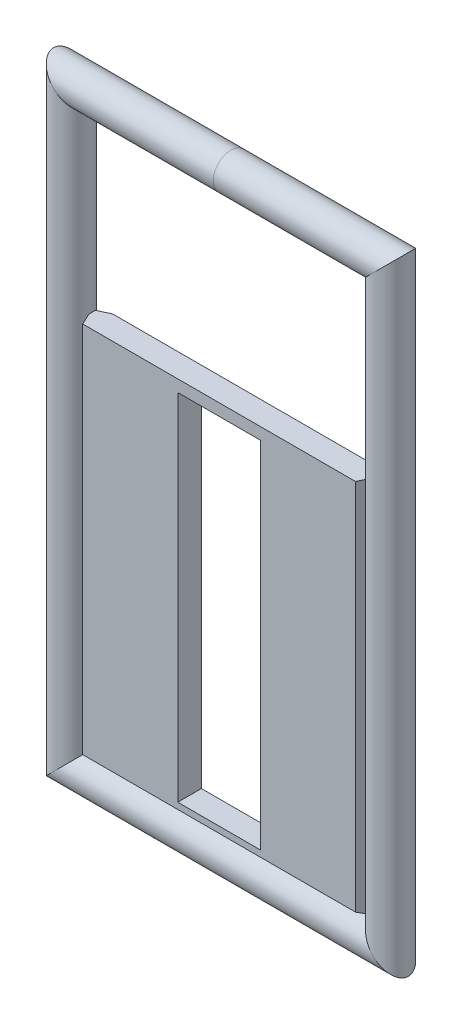
ISO-10303-21;
HEADER;
FILE_DESCRIPTION(('STEP AP214'),'2;1');
FILE_NAME('part.step','',(''),(''),'','','');
FILE_SCHEMA(('AUTOMOTIVE_DESIGN { 1 0 10303 214 1 1 1 1 }'));
ENDSEC;
DATA;
#1=APPLICATION_CONTEXT('core data for automotive mechanical design processes');
#2=APPLICATION_PROTOCOL_DEFINITION('international standard','automotive_design',2000,#1);
#3=PRODUCT_CONTEXT('',#1,'mechanical');
#4=PRODUCT('Part','Part','',(#3));
#5=PRODUCT_RELATED_PRODUCT_CATEGORY('part','',(#4));
#6=PRODUCT_DEFINITION_FORMATION('','',#4);
#7=PRODUCT_DEFINITION_CONTEXT('part definition',#1,'design');
#8=PRODUCT_DEFINITION('design','',#6,#7);
#9=PRODUCT_DEFINITION_SHAPE('','',#8);
#10=(LENGTH_UNIT() NAMED_UNIT(*) SI_UNIT(.MILLI.,.METRE.));
#11=(NAMED_UNIT(*) PLANE_ANGLE_UNIT() SI_UNIT($,.RADIAN.));
#12=(NAMED_UNIT(*) SI_UNIT($,.STERADIAN.) SOLID_ANGLE_UNIT());
#13=UNCERTAINTY_MEASURE_WITH_UNIT(LENGTH_MEASURE(1.E-05),#10,'distance_accuracy_value','');
#14=(GEOMETRIC_REPRESENTATION_CONTEXT(3) GLOBAL_UNCERTAINTY_ASSIGNED_CONTEXT((#13)) GLOBAL_UNIT_ASSIGNED_CONTEXT((#10,
#11,#12)) REPRESENTATION_CONTEXT('',''));
#15=CARTESIAN_POINT('',(0.,0.,0.));
#16=DIRECTION('',(0.,0.,1.));
#17=DIRECTION('',(1.,0.,0.));
#18=AXIS2_PLACEMENT_3D('',#15,#16,#17);
#19=CARTESIAN_POINT('',(6.,-24.25,-0.5));
#20=DIRECTION('',(1.,0.,0.));
#21=DIRECTION('',(0.,0.,-1.));
#22=AXIS2_PLACEMENT_3D('',#19,#20,#21);
#23=PLANE('',#22);
#24=DIRECTION('',(0.,0.,1.));
#25=VECTOR('',#24,1.);
#26=CARTESIAN_POINT('',(6.,-24.25,-0.5));
#27=LINE('',#26,#25);
#28=CARTESIAN_POINT('',(6.,-24.25,-0.266846170922501));
#29=VERTEX_POINT('',#28);
#30=CARTESIAN_POINT('',(6.,-24.25,0.));
#31=VERTEX_POINT('',#30);
#32=EDGE_CURVE('E202',#29,#31,#27,.T.);
#33=ORIENTED_EDGE('',*,*,#32,.F.);
#34=DIRECTION('',(0.,1.,0.));
#35=VECTOR('',#34,1.);
#36=CARTESIAN_POINT('',(6.,-8.25,-0.266846170922501));
#37=LINE('',#36,#35);
#38=CARTESIAN_POINT('',(6.,-8.25,-0.266846170922501));
#39=VERTEX_POINT('',#38);
#40=EDGE_CURVE('E240',#29,#39,#37,.T.);
#41=ORIENTED_EDGE('',*,*,#40,.T.);
#42=DIRECTION('',(0.,0.,1.));
#43=VECTOR('',#42,1.);
#44=CARTESIAN_POINT('',(6.,-8.25,-0.5));
#45=LINE('',#44,#43);
#46=CARTESIAN_POINT('',(6.,-8.25,0.));
#47=VERTEX_POINT('',#46);
#48=EDGE_CURVE('E201',#39,#47,#45,.T.);
#49=ORIENTED_EDGE('',*,*,#48,.T.);
#50=DIRECTION('',(0.,-1.,0.));
#51=VECTOR('',#50,1.);
#52=CARTESIAN_POINT('',(6.,-24.25,0.));
#53=LINE('',#52,#51);
#54=EDGE_CURVE('E238',#47,#31,#53,.T.);
#55=ORIENTED_EDGE('',*,*,#54,.T.);
#56=EDGE_LOOP('',(#33,#41,#49,#55));
#57=FACE_BOUND('',#56,.T.);
#58=ADVANCED_FACE('F60',(#57),#23,.T.);
#59=CARTESIAN_POINT('',(6.,-24.25,-0.5));
#60=DIRECTION('',(0.,-1.,0.));
#61=DIRECTION('',(0.,0.,-1.));
#62=AXIS2_PLACEMENT_3D('',#59,#60,#61);
#63=PLANE('',#62);
#64=DIRECTION('',(0.,0.,1.));
#65=VECTOR('',#64,1.);
#66=CARTESIAN_POINT('',(-6.,-24.25,-0.5));
#67=LINE('',#66,#65);
#68=CARTESIAN_POINT('',(-6.,-24.25,-0.266846170922501));
#69=VERTEX_POINT('',#68);
#70=CARTESIAN_POINT('',(-6.,-24.25,0.));
#71=VERTEX_POINT('',#70);
#72=EDGE_CURVE('E206',#69,#71,#67,.T.);
#73=ORIENTED_EDGE('',*,*,#72,.F.);
#74=DIRECTION('',(1.,0.,0.));
#75=VECTOR('',#74,1.);
#76=CARTESIAN_POINT('',(6.,-24.25,-0.266846170922501));
#77=LINE('',#76,#75);
#78=EDGE_CURVE('E236',#69,#29,#77,.T.);
#79=ORIENTED_EDGE('',*,*,#78,.T.);
#80=ORIENTED_EDGE('',*,*,#32,.T.);
#81=DIRECTION('',(-1.,0.,0.));
#82=VECTOR('',#81,1.);
#83=CARTESIAN_POINT('',(6.,-24.25,0.));
#84=LINE('',#83,#82);
#85=EDGE_CURVE('E234',#31,#71,#84,.T.);
#86=ORIENTED_EDGE('',*,*,#85,.T.);
#87=EDGE_LOOP('',(#73,#79,#80,#86));
#88=FACE_BOUND('',#87,.T.);
#89=ADVANCED_FACE('F275',(#88),#63,.T.);
#90=CARTESIAN_POINT('',(-6.,-24.25,-0.5));
#91=DIRECTION('',(-1.,0.,0.));
#92=DIRECTION('',(0.,-1.,0.));
#93=AXIS2_PLACEMENT_3D('',#90,#91,#92);
#94=PLANE('',#93);
#95=DIRECTION('',(0.,0.,1.));
#96=VECTOR('',#95,1.);
#97=CARTESIAN_POINT('',(-6.,-8.25,-0.5));
#98=LINE('',#97,#96);
#99=CARTESIAN_POINT('',(-6.,-8.25,-0.266846170922501));
#100=VERTEX_POINT('',#99);
#101=CARTESIAN_POINT('',(-6.,-8.25,0.));
#102=VERTEX_POINT('',#101);
#103=EDGE_CURVE('E209',#100,#102,#98,.T.);
#104=ORIENTED_EDGE('',*,*,#103,.F.);
#105=DIRECTION('',(0.,-1.,0.));
#106=VECTOR('',#105,1.);
#107=CARTESIAN_POINT('',(-6.,-24.25,-0.266846170922501));
#108=LINE('',#107,#106);
#109=EDGE_CURVE('E215',#100,#69,#108,.T.);
#110=ORIENTED_EDGE('',*,*,#109,.T.);
#111=ORIENTED_EDGE('',*,*,#72,.T.);
#112=DIRECTION('',(0.,1.,0.));
#113=VECTOR('',#112,1.);
#114=CARTESIAN_POINT('',(-6.,-24.25,0.));
#115=LINE('',#114,#113);
#116=EDGE_CURVE('E205',#71,#102,#115,.T.);
#117=ORIENTED_EDGE('',*,*,#116,.T.);
#118=EDGE_LOOP('',(#104,#110,#111,#117));
#119=FACE_BOUND('',#118,.T.);
#120=ADVANCED_FACE('F261',(#119),#94,.T.);
#121=CARTESIAN_POINT('',(6.,-8.25,-0.5));
#122=DIRECTION('',(0.,1.,0.));
#123=DIRECTION('',(0.,0.,1.));
#124=AXIS2_PLACEMENT_3D('',#121,#122,#123);
#125=PLANE('',#124);
#126=DIRECTION('',(-1.,0.,0.));
#127=VECTOR('',#126,1.);
#128=CARTESIAN_POINT('',(6.,-8.25,-0.5));
#129=LINE('',#128,#127);
#130=CARTESIAN_POINT('',(5.5,-8.25,-0.5));
#131=VERTEX_POINT('',#130);
#132=CARTESIAN_POINT('',(-5.49999999999999,-8.25,-0.5));
#133=VERTEX_POINT('',#132);
#134=EDGE_CURVE('E195',#131,#133,#129,.T.);
#135=ORIENTED_EDGE('',*,*,#134,.T.);
#136=DIRECTION('',(-0.906307787036651,0.,0.422618261740697));
#137=VECTOR('',#136,1.);
#138=CARTESIAN_POINT('',(3.94602875569763,-8.25,-4.9047555479341));
#139=LINE('',#138,#137);
#140=EDGE_CURVE('E232',#133,#100,#139,.T.);
#141=ORIENTED_EDGE('',*,*,#140,.T.);
#142=ORIENTED_EDGE('',*,*,#103,.T.);
#143=DIRECTION('',(-0.422618261740696,0.,-0.906307787036652));
#144=VECTOR('',#143,1.);
#145=CARTESIAN_POINT('',(-4.04823676889901,-8.25,4.1855697562922));
#146=LINE('',#145,#144);
#147=CARTESIAN_POINT('',(-5.7668461709225,-8.25,0.5));
#148=VERTEX_POINT('',#147);
#149=EDGE_CURVE('E226',#102,#148,#146,.F.);
#150=ORIENTED_EDGE('',*,*,#149,.T.);
#151=DIRECTION('',(-1.,0.,0.));
#152=VECTOR('',#151,1.);
#153=CARTESIAN_POINT('',(6.,-8.25,0.5));
#154=LINE('',#153,#152);
#155=CARTESIAN_POINT('',(5.7668461709225,-8.25,0.5));
#156=VERTEX_POINT('',#155);
#157=EDGE_CURVE('E184',#156,#148,#154,.T.);
#158=ORIENTED_EDGE('',*,*,#157,.F.);
#159=DIRECTION('',(-0.422618261740697,0.,0.906307787036651));
#160=VECTOR('',#159,1.);
#161=CARTESIAN_POINT('',(6.19151111077974,-8.25,-0.410696902421637));
#162=LINE('',#161,#160);
#163=EDGE_CURVE('E228',#156,#47,#162,.F.);
#164=ORIENTED_EDGE('',*,*,#163,.T.);
#165=ORIENTED_EDGE('',*,*,#48,.F.);
#166=DIRECTION('',(-0.906307787036651,0.,-0.422618261740697));
#167=VECTOR('',#166,1.);
#168=CARTESIAN_POINT('',(5.91069690242163,-8.25,-0.308488889220255));
#169=LINE('',#168,#167);
#170=EDGE_CURVE('E230',#39,#131,#169,.T.);
#171=ORIENTED_EDGE('',*,*,#170,.T.);
#172=EDGE_LOOP('',(#135,#141,#142,#150,#158,#164,#165,#171));
#173=FACE_BOUND('',#172,.T.);
#174=ADVANCED_FACE('F265',(#173),#125,.T.);
#175=CARTESIAN_POINT('',(0.,0.,-0.5));
#176=DIRECTION('',(0.,0.,1.));
#177=DIRECTION('',(1.,0.,0.));
#178=AXIS2_PLACEMENT_3D('',#175,#176,#177);
#179=PLANE('',#178);
#180=DIRECTION('',(-1.,0.,0.));
#181=VECTOR('',#180,1.);
#182=CARTESIAN_POINT('',(-6.,-23.75,-0.5));
#183=LINE('',#182,#181);
#184=CARTESIAN_POINT('',(-1.75,-23.75,-0.5));
#185=VERTEX_POINT('',#184);
#186=CARTESIAN_POINT('',(-5.49999999999999,-23.75,-0.5));
#187=VERTEX_POINT('',#186);
#188=EDGE_CURVE('E222',#185,#187,#183,.T.);
#189=ORIENTED_EDGE('',*,*,#188,.T.);
#190=DIRECTION('',(0.,1.,0.));
#191=VECTOR('',#190,1.);
#192=CARTESIAN_POINT('',(-5.49999999999999,-8.25,-0.5));
#193=LINE('',#192,#191);
#194=EDGE_CURVE('E224',#187,#133,#193,.T.);
#195=ORIENTED_EDGE('',*,*,#194,.T.);
#196=ORIENTED_EDGE('',*,*,#134,.F.);
#197=DIRECTION('',(0.,-1.,0.));
#198=VECTOR('',#197,1.);
#199=CARTESIAN_POINT('',(5.5,-24.25,-0.5));
#200=LINE('',#199,#198);
#201=CARTESIAN_POINT('',(5.5,-23.75,-0.5));
#202=VERTEX_POINT('',#201);
#203=EDGE_CURVE('E218',#131,#202,#200,.T.);
#204=ORIENTED_EDGE('',*,*,#203,.T.);
#205=DIRECTION('',(-1.,0.,0.));
#206=VECTOR('',#205,1.);
#207=CARTESIAN_POINT('',(-6.,-23.75,-0.5));
#208=LINE('',#207,#206);
#209=CARTESIAN_POINT('',(1.75,-23.75,-0.5));
#210=VERTEX_POINT('',#209);
#211=EDGE_CURVE('E220',#202,#210,#208,.T.);
#212=ORIENTED_EDGE('',*,*,#211,.T.);
#213=DIRECTION('',(0.,1.,0.));
#214=VECTOR('',#213,1.);
#215=CARTESIAN_POINT('',(1.75,-8.75,-0.5));
#216=LINE('',#215,#214);
#217=CARTESIAN_POINT('',(1.75,-8.75,-0.5));
#218=VERTEX_POINT('',#217);
#219=EDGE_CURVE('E186',#210,#218,#216,.T.);
#220=ORIENTED_EDGE('',*,*,#219,.T.);
#221=DIRECTION('',(-1.,0.,0.));
#222=VECTOR('',#221,1.);
#223=CARTESIAN_POINT('',(-1.75,-8.75,-0.5));
#224=LINE('',#223,#222);
#225=CARTESIAN_POINT('',(-1.75,-8.75,-0.5));
#226=VERTEX_POINT('',#225);
#227=EDGE_CURVE('E159',#218,#226,#224,.T.);
#228=ORIENTED_EDGE('',*,*,#227,.T.);
#229=DIRECTION('',(0.,-1.,0.));
#230=VECTOR('',#229,1.);
#231=CARTESIAN_POINT('',(-1.75,-8.75,-0.5));
#232=LINE('',#231,#230);
#233=EDGE_CURVE('E189',#226,#185,#232,.T.);
#234=ORIENTED_EDGE('',*,*,#233,.T.);
#235=EDGE_LOOP('',(#189,#195,#196,#204,#212,#220,#228,#234));
#236=FACE_BOUND('',#235,.T.);
#237=ADVANCED_FACE('F291',(#236),#179,.F.);
#238=CARTESIAN_POINT('',(1.75,-8.75,-0.5));
#239=DIRECTION('',(1.,0.,0.));
#240=DIRECTION('',(0.,1.,0.));
#241=AXIS2_PLACEMENT_3D('',#238,#239,#240);
#242=PLANE('',#241);
#243=DIRECTION('',(0.,0.,1.));
#244=VECTOR('',#243,1.);
#245=CARTESIAN_POINT('',(1.75,-23.75,-0.5));
#246=LINE('',#245,#244);
#247=CARTESIAN_POINT('',(1.75,-23.75,0.5));
#248=VERTEX_POINT('',#247);
#249=EDGE_CURVE('E170',#210,#248,#246,.T.);
#250=ORIENTED_EDGE('',*,*,#249,.T.);
#251=DIRECTION('',(0.,1.,0.));
#252=VECTOR('',#251,1.);
#253=CARTESIAN_POINT('',(1.75,-8.75,0.5));
#254=LINE('',#253,#252);
#255=CARTESIAN_POINT('',(1.75,-8.75,0.5));
#256=VERTEX_POINT('',#255);
#257=EDGE_CURVE('E167',#248,#256,#254,.T.);
#258=ORIENTED_EDGE('',*,*,#257,.T.);
#259=DIRECTION('',(0.,0.,1.));
#260=VECTOR('',#259,1.);
#261=CARTESIAN_POINT('',(1.75,-8.75,-0.5));
#262=LINE('',#261,#260);
#263=EDGE_CURVE('E151',#218,#256,#262,.T.);
#264=ORIENTED_EDGE('',*,*,#263,.F.);
#265=ORIENTED_EDGE('',*,*,#219,.F.);
#266=EDGE_LOOP('',(#250,#258,#264,#265));
#267=FACE_BOUND('',#266,.T.);
#268=ADVANCED_FACE('F168',(#267),#242,.F.);
#269=CARTESIAN_POINT('',(-1.75,-23.75,-0.5));
#270=DIRECTION('',(0.,-1.,0.));
#271=DIRECTION('',(0.,0.,-1.));
#272=AXIS2_PLACEMENT_3D('',#269,#270,#271);
#273=PLANE('',#272);
#274=DIRECTION('',(0.,0.,1.));
#275=VECTOR('',#274,1.);
#276=CARTESIAN_POINT('',(-1.75,-23.75,-0.5));
#277=LINE('',#276,#275);
#278=CARTESIAN_POINT('',(-1.75,-23.75,0.5));
#279=VERTEX_POINT('',#278);
#280=EDGE_CURVE('E196',#185,#279,#277,.T.);
#281=ORIENTED_EDGE('',*,*,#280,.T.);
#282=DIRECTION('',(1.,0.,0.));
#283=VECTOR('',#282,1.);
#284=CARTESIAN_POINT('',(-1.75,-23.75,0.5));
#285=LINE('',#284,#283);
#286=EDGE_CURVE('E180',#279,#248,#285,.T.);
#287=ORIENTED_EDGE('',*,*,#286,.T.);
#288=ORIENTED_EDGE('',*,*,#249,.F.);
#289=DIRECTION('',(1.,0.,0.));
#290=VECTOR('',#289,1.);
#291=CARTESIAN_POINT('',(-1.75,-23.75,-0.5));
#292=LINE('',#291,#290);
#293=EDGE_CURVE('E164',#185,#210,#292,.T.);
#294=ORIENTED_EDGE('',*,*,#293,.F.);
#295=EDGE_LOOP('',(#281,#287,#288,#294));
#296=FACE_BOUND('',#295,.T.);
#297=ADVANCED_FACE('F293',(#296),#273,.F.);
#298=CARTESIAN_POINT('',(-1.75,-8.75,-0.5));
#299=DIRECTION('',(-1.,0.,0.));
#300=DIRECTION('',(0.,-1.,0.));
#301=AXIS2_PLACEMENT_3D('',#298,#299,#300);
#302=PLANE('',#301);
#303=DIRECTION('',(0.,0.,1.));
#304=VECTOR('',#303,1.);
#305=CARTESIAN_POINT('',(-1.75,-8.75,-0.5));
#306=LINE('',#305,#304);
#307=CARTESIAN_POINT('',(-1.75,-8.75,0.5));
#308=VERTEX_POINT('',#307);
#309=EDGE_CURVE('E163',#226,#308,#306,.T.);
#310=ORIENTED_EDGE('',*,*,#309,.T.);
#311=DIRECTION('',(0.,-1.,0.));
#312=VECTOR('',#311,1.);
#313=CARTESIAN_POINT('',(-1.75,-8.75,0.5));
#314=LINE('',#313,#312);
#315=EDGE_CURVE('E178',#308,#279,#314,.T.);
#316=ORIENTED_EDGE('',*,*,#315,.T.);
#317=ORIENTED_EDGE('',*,*,#280,.F.);
#318=ORIENTED_EDGE('',*,*,#233,.F.);
#319=EDGE_LOOP('',(#310,#316,#317,#318));
#320=FACE_BOUND('',#319,.T.);
#321=ADVANCED_FACE('F295',(#320),#302,.F.);
#322=CARTESIAN_POINT('',(-1.75,-8.75,-0.5));
#323=DIRECTION('',(0.,1.,0.));
#324=DIRECTION('',(0.,0.,1.));
#325=AXIS2_PLACEMENT_3D('',#322,#323,#324);
#326=PLANE('',#325);
#327=ORIENTED_EDGE('',*,*,#263,.T.);
#328=DIRECTION('',(-1.,0.,0.));
#329=VECTOR('',#328,1.);
#330=CARTESIAN_POINT('',(-1.75,-8.75,0.5));
#331=LINE('',#330,#329);
#332=EDGE_CURVE('E156',#256,#308,#331,.T.);
#333=ORIENTED_EDGE('',*,*,#332,.T.);
#334=ORIENTED_EDGE('',*,*,#309,.F.);
#335=ORIENTED_EDGE('',*,*,#227,.F.);
#336=EDGE_LOOP('',(#327,#333,#334,#335));
#337=FACE_BOUND('',#336,.T.);
#338=ADVANCED_FACE('F153',(#337),#326,.F.);
#339=CARTESIAN_POINT('',(0.,0.,0.5));
#340=DIRECTION('',(0.,0.,1.));
#341=DIRECTION('',(1.,0.,0.));
#342=AXIS2_PLACEMENT_3D('',#339,#340,#341);
#343=PLANE('',#342);
#344=DIRECTION('',(1.,0.,0.));
#345=VECTOR('',#344,1.);
#346=CARTESIAN_POINT('',(0.,-24.0168461709225,0.5));
#347=LINE('',#346,#345);
#348=CARTESIAN_POINT('',(-5.7668461709225,-24.0168461709225,0.5));
#349=VERTEX_POINT('',#348);
#350=CARTESIAN_POINT('',(5.7668461709225,-24.0168461709225,0.5));
#351=VERTEX_POINT('',#350);
#352=EDGE_CURVE('E70',#349,#351,#347,.T.);
#353=ORIENTED_EDGE('',*,*,#352,.T.);
#354=DIRECTION('',(0.,1.,0.));
#355=VECTOR('',#354,1.);
#356=CARTESIAN_POINT('',(5.7668461709225,0.,0.5));
#357=LINE('',#356,#355);
#358=EDGE_CURVE('E13',#351,#156,#357,.T.);
#359=ORIENTED_EDGE('',*,*,#358,.T.);
#360=ORIENTED_EDGE('',*,*,#157,.T.);
#361=DIRECTION('',(0.,-1.,0.));
#362=VECTOR('',#361,1.);
#363=CARTESIAN_POINT('',(-5.7668461709225,0.,0.5));
#364=LINE('',#363,#362);
#365=EDGE_CURVE('E81',#148,#349,#364,.T.);
#366=ORIENTED_EDGE('',*,*,#365,.T.);
#367=EDGE_LOOP('',(#353,#359,#360,#366));
#368=FACE_BOUND('',#367,.T.);
#369=ORIENTED_EDGE('',*,*,#332,.F.);
#370=ORIENTED_EDGE('',*,*,#257,.F.);
#371=ORIENTED_EDGE('',*,*,#286,.F.);
#372=ORIENTED_EDGE('',*,*,#315,.F.);
#373=EDGE_LOOP('',(#369,#370,#371,#372));
#374=FACE_BOUND('',#373,.T.);
#375=ADVANCED_FACE('F176',(#368,#374),#343,.T.);
#376=CARTESIAN_POINT('',(6.,-24.25,-0.266846170922501));
#377=DIRECTION('',(0.422618261740697,0.,-0.906307787036651));
#378=DIRECTION('',(0.,-1.,0.));
#379=AXIS2_PLACEMENT_3D('',#376,#377,#378);
#380=PLANE('',#379);
#381=ORIENTED_EDGE('',*,*,#170,.F.);
#382=ORIENTED_EDGE('',*,*,#40,.F.);
#383=DIRECTION('',(-0.671542934237819,0.671542934237819,-0.313145613014971));
#384=VECTOR('',#383,1.);
#385=CARTESIAN_POINT('',(6.,-24.25,-0.266846170922501));
#386=LINE('',#385,#384);
#387=EDGE_CURVE('E174',#202,#29,#386,.F.);
#388=ORIENTED_EDGE('',*,*,#387,.F.);
#389=ORIENTED_EDGE('',*,*,#203,.F.);
#390=EDGE_LOOP('',(#381,#382,#388,#389));
#391=FACE_BOUND('',#390,.T.);
#392=ADVANCED_FACE('F283',(#391),#380,.T.);
#393=CARTESIAN_POINT('',(6.,-24.25,-0.266846170922501));
#394=DIRECTION('',(0.,-0.422618261740697,-0.906307787036651));
#395=DIRECTION('',(-1.,0.,0.));
#396=AXIS2_PLACEMENT_3D('',#393,#394,#395);
#397=PLANE('',#396);
#398=ORIENTED_EDGE('',*,*,#387,.T.);
#399=ORIENTED_EDGE('',*,*,#78,.F.);
#400=DIRECTION('',(0.671542934237818,0.671542934237819,-0.313145613014971));
#401=VECTOR('',#400,1.);
#402=CARTESIAN_POINT('',(-0.588361049703137,-18.8383610497031,-2.79033485661579));
#403=LINE('',#402,#401);
#404=EDGE_CURVE('E244',#187,#69,#403,.F.);
#405=ORIENTED_EDGE('',*,*,#404,.F.);
#406=ORIENTED_EDGE('',*,*,#188,.F.);
#407=ORIENTED_EDGE('',*,*,#293,.T.);
#408=ORIENTED_EDGE('',*,*,#211,.F.);
#409=EDGE_LOOP('',(#398,#399,#405,#406,#407,#408));
#410=FACE_BOUND('',#409,.T.);
#411=ADVANCED_FACE('F287',(#410),#397,.T.);
#412=CARTESIAN_POINT('',(-6.,-24.25,-0.266846170922501));
#413=DIRECTION('',(-0.422618261740697,0.,-0.906307787036651));
#414=DIRECTION('',(0.,1.,0.));
#415=AXIS2_PLACEMENT_3D('',#412,#413,#414);
#416=PLANE('',#415);
#417=ORIENTED_EDGE('',*,*,#140,.F.);
#418=ORIENTED_EDGE('',*,*,#194,.F.);
#419=ORIENTED_EDGE('',*,*,#404,.T.);
#420=ORIENTED_EDGE('',*,*,#109,.F.);
#421=EDGE_LOOP('',(#417,#418,#419,#420));
#422=FACE_BOUND('',#421,.T.);
#423=ADVANCED_FACE('F271',(#422),#416,.T.);
#424=CARTESIAN_POINT('',(-5.7668461709225,0.,0.5));
#425=DIRECTION('',(0.906307787036652,0.,-0.422618261740696));
#426=DIRECTION('',(0.,-1.,0.));
#427=AXIS2_PLACEMENT_3D('',#424,#425,#426);
#428=PLANE('',#427);
#429=ORIENTED_EDGE('',*,*,#149,.F.);
#430=ORIENTED_EDGE('',*,*,#116,.F.);
#431=DIRECTION('',(0.389281620635022,0.389281620635025,0.834817129478989));
#432=VECTOR('',#431,1.);
#433=CARTESIAN_POINT('',(-2.1273289752043,-20.3773289752043,8.3049698135313));
#434=LINE('',#433,#432);
#435=EDGE_CURVE('E65',#349,#71,#434,.F.);
#436=ORIENTED_EDGE('',*,*,#435,.F.);
#437=ORIENTED_EDGE('',*,*,#365,.F.);
#438=EDGE_LOOP('',(#429,#430,#436,#437));
#439=FACE_BOUND('',#438,.T.);
#440=ADVANCED_FACE('F63',(#439),#428,.F.);
#441=CARTESIAN_POINT('',(0.,-24.0168461709225,0.5));
#442=DIRECTION('',(0.,0.90630778703665,-0.422618261740699));
#443=DIRECTION('',(1.,0.,0.));
#444=AXIS2_PLACEMENT_3D('',#441,#442,#443);
#445=PLANE('',#444);
#446=ORIENTED_EDGE('',*,*,#435,.T.);
#447=ORIENTED_EDGE('',*,*,#85,.F.);
#448=DIRECTION('',(-0.389281620635022,0.389281620635025,0.834817129478989));
#449=VECTOR('',#448,1.);
#450=CARTESIAN_POINT('',(4.89293726320151,-23.1429372632015,2.37410370050263));
#451=LINE('',#450,#449);
#452=EDGE_CURVE('E247',#351,#31,#451,.F.);
#453=ORIENTED_EDGE('',*,*,#452,.F.);
#454=ORIENTED_EDGE('',*,*,#352,.F.);
#455=EDGE_LOOP('',(#446,#447,#453,#454));
#456=FACE_BOUND('',#455,.T.);
#457=ADVANCED_FACE('F255',(#456),#445,.F.);
#458=CARTESIAN_POINT('',(5.7668461709225,0.,0.5));
#459=DIRECTION('',(-0.906307787036651,0.,-0.422618261740697));
#460=DIRECTION('',(0.,1.,0.));
#461=AXIS2_PLACEMENT_3D('',#458,#459,#460);
#462=PLANE('',#461);
#463=ORIENTED_EDGE('',*,*,#452,.T.);
#464=ORIENTED_EDGE('',*,*,#54,.F.);
#465=ORIENTED_EDGE('',*,*,#163,.F.);
#466=ORIENTED_EDGE('',*,*,#358,.F.);
#467=EDGE_LOOP('',(#463,#464,#465,#466));
#468=FACE_BOUND('',#467,.T.);
#469=ADVANCED_FACE('F329',(#468),#462,.F.);
#470=CLOSED_SHELL('',(#58,#89,#120,#174,#237,#268,#297,#321,#338,#375,#392,#411,#423,#440,#457,#469));
#471=MANIFOLD_SOLID_BREP('B2',#470);
#472=CARTESIAN_POINT('',(-6.75,0.925000000000002,0.));
#473=DIRECTION('',(0.,-1.,0.));
#474=DIRECTION('',(1.,0.,0.));
#475=AXIS2_PLACEMENT_3D('',#472,#473,#474);
#476=CYLINDRICAL_SURFACE('',#475,0.75);
#477=CARTESIAN_POINT('',(-6.75,0.,0.));
#478=DIRECTION('',(-0.707106781186547,-0.707106781186548,0.));
#479=DIRECTION('',(-0.707106781186548,0.707106781186547,0.));
#480=AXIS2_PLACEMENT_3D('',#477,#478,#479);
#481=ELLIPSE('',#480,1.06066017177982,0.75);
#482=CARTESIAN_POINT('',(-7.5,0.75,0.));
#483=VERTEX_POINT('',#482);
#484=EDGE_CURVE('E490',#483,#483,#481,.F.);
#485=ORIENTED_EDGE('',*,*,#484,.F.);
#486=EDGE_LOOP('',(#485));
#487=FACE_BOUND('',#486,.T.);
#488=CARTESIAN_POINT('',(-6.75,-25.,0.));
#489=DIRECTION('',(0.707106781186548,-0.707106781186547,0.));
#490=DIRECTION('',(0.707106781186547,0.707106781186548,0.));
#491=AXIS2_PLACEMENT_3D('',#488,#489,#490);
#492=ELLIPSE('',#491,1.06066017177982,0.75);
#493=CARTESIAN_POINT('',(-6.,-24.25,0.));
#494=VERTEX_POINT('',#493);
#495=EDGE_CURVE('E477',#494,#494,#492,.F.);
#496=ORIENTED_EDGE('',*,*,#495,.T.);
#497=EDGE_LOOP('',(#496));
#498=FACE_BOUND('',#497,.T.);
#499=ADVANCED_FACE('F474',(#487,#498),#476,.T.);
#500=CARTESIAN_POINT('',(-7.675,-25.,0.));
#501=DIRECTION('',(1.,0.,0.));
#502=DIRECTION('',(0.,0.,-1.));
#503=AXIS2_PLACEMENT_3D('',#500,#501,#502);
#504=CYLINDRICAL_SURFACE('',#503,0.75);
#505=ORIENTED_EDGE('',*,*,#495,.F.);
#506=EDGE_LOOP('',(#505));
#507=FACE_BOUND('',#506,.T.);
#508=CARTESIAN_POINT('',(6.75,-25.,0.));
#509=DIRECTION('',(0.707106781186548,0.707106781186548,0.));
#510=DIRECTION('',(-0.707106781186548,0.707106781186548,0.));
#511=AXIS2_PLACEMENT_3D('',#508,#509,#510);
#512=ELLIPSE('',#511,1.06066017177982,0.75);
#513=CARTESIAN_POINT('',(6.,-24.25,0.));
#514=VERTEX_POINT('',#513);
#515=EDGE_CURVE('E481',#514,#514,#512,.F.);
#516=ORIENTED_EDGE('',*,*,#515,.T.);
#517=EDGE_LOOP('',(#516));
#518=FACE_BOUND('',#517,.T.);
#519=ADVANCED_FACE('F498',(#507,#518),#504,.T.);
#520=CARTESIAN_POINT('',(7.675,0.,0.));
#521=DIRECTION('',(-1.,0.,0.));
#522=DIRECTION('',(0.,0.,1.));
#523=AXIS2_PLACEMENT_3D('',#520,#521,#522);
#524=CYLINDRICAL_SURFACE('',#523,0.75);
#525=CARTESIAN_POINT('',(6.75,0.,0.));
#526=DIRECTION('',(-0.707106781186548,0.707106781186548,0.));
#527=DIRECTION('',(0.707106781186548,0.707106781186548,0.));
#528=AXIS2_PLACEMENT_3D('',#525,#526,#527);
#529=ELLIPSE('',#528,1.06066017177982,0.75);
#530=CARTESIAN_POINT('',(7.5,0.75,0.));
#531=VERTEX_POINT('',#530);
#532=EDGE_CURVE('E59',#531,#531,#529,.F.);
#533=ORIENTED_EDGE('',*,*,#532,.F.);
#534=EDGE_LOOP('',(#533));
#535=FACE_BOUND('',#534,.T.);
#536=CARTESIAN_POINT('',(0.,0.,0.));
#537=DIRECTION('',(-1.,0.,0.));
#538=DIRECTION('',(0.,-1.,0.));
#539=AXIS2_PLACEMENT_3D('',#536,#537,#538);
#540=CIRCLE('',#539,0.75);
#541=CARTESIAN_POINT('',(0.,-0.75,0.));
#542=VERTEX_POINT('',#541);
#543=EDGE_CURVE('E486',#542,#542,#540,.T.);
#544=ORIENTED_EDGE('',*,*,#543,.F.);
#545=EDGE_LOOP('',(#544));
#546=FACE_BOUND('',#545,.T.);
#547=ADVANCED_FACE('F501',(#535,#546),#524,.T.);
#548=CARTESIAN_POINT('',(0.,0.,0.));
#549=DIRECTION('',(-1.,0.,0.));
#550=DIRECTION('',(0.,0.,1.));
#551=AXIS2_PLACEMENT_3D('',#548,#549,#550);
#552=CYLINDRICAL_SURFACE('',#551,0.75);
#553=ORIENTED_EDGE('',*,*,#543,.T.);
#554=EDGE_LOOP('',(#553));
#555=FACE_BOUND('',#554,.T.);
#556=ORIENTED_EDGE('',*,*,#484,.T.);
#557=EDGE_LOOP('',(#556));
#558=FACE_BOUND('',#557,.T.);
#559=ADVANCED_FACE('F506',(#555,#558),#552,.T.);
#560=CARTESIAN_POINT('',(6.75,-25.925,0.));
#561=DIRECTION('',(0.,1.,0.));
#562=DIRECTION('',(-1.,0.,0.));
#563=AXIS2_PLACEMENT_3D('',#560,#561,#562);
#564=CYLINDRICAL_SURFACE('',#563,0.75);
#565=ORIENTED_EDGE('',*,*,#515,.F.);
#566=EDGE_LOOP('',(#565));
#567=FACE_BOUND('',#566,.T.);
#568=ORIENTED_EDGE('',*,*,#532,.T.);
#569=EDGE_LOOP('',(#568));
#570=FACE_BOUND('',#569,.T.);
#571=ADVANCED_FACE('F504',(#567,#570),#564,.T.);
#572=CLOSED_SHELL('',(#499,#519,#547,#559,#571));
#573=MANIFOLD_SOLID_BREP('B7',#572);
#574=ADVANCED_BREP_SHAPE_REPRESENTATION('',(#18,#471,#573),#14);
#575=SHAPE_DEFINITION_REPRESENTATION(#9,#574);
ENDSEC;
END-ISO-10303-21;
